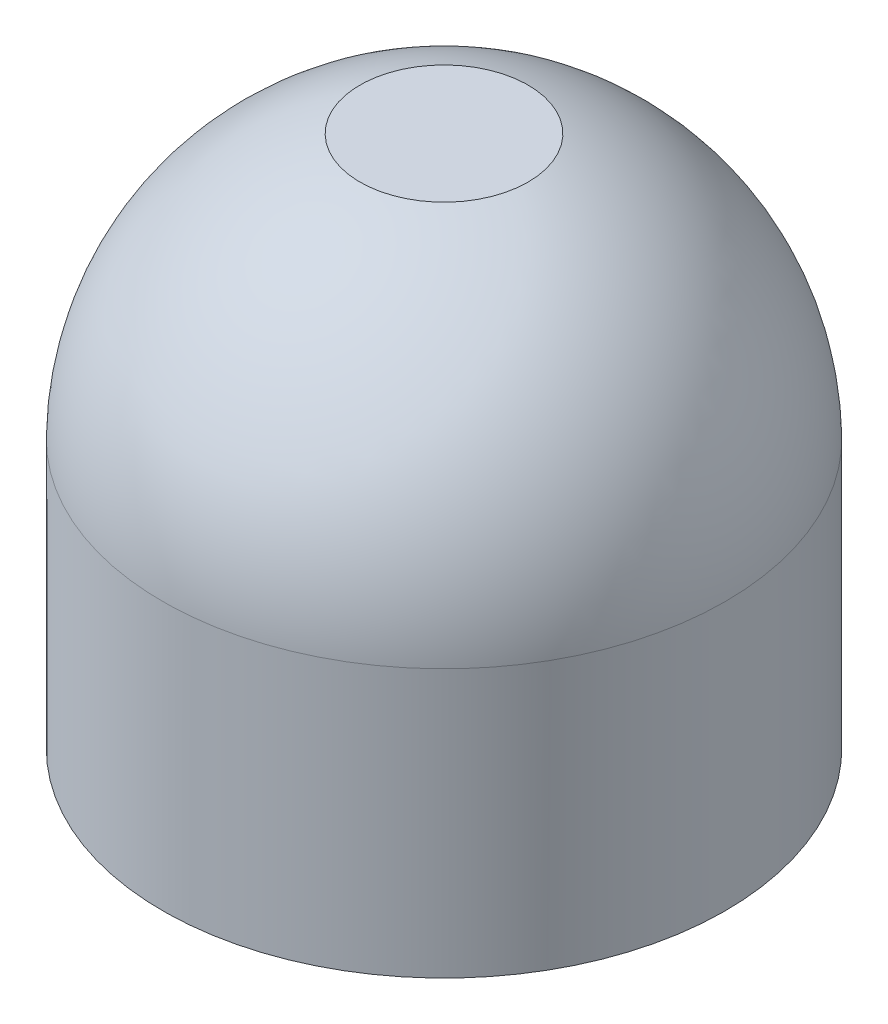
ISO-10303-21;
HEADER;
FILE_DESCRIPTION(('STEP AP214'),'2;1');
FILE_NAME('part.step','',(''),(''),'','','');
FILE_SCHEMA(('AUTOMOTIVE_DESIGN { 1 0 10303 214 1 1 1 1 }'));
ENDSEC;
DATA;
#1=APPLICATION_CONTEXT('core data for automotive mechanical design processes');
#2=APPLICATION_PROTOCOL_DEFINITION('international standard','automotive_design',2000,#1);
#3=PRODUCT_CONTEXT('',#1,'mechanical');
#4=PRODUCT('Part','Part','',(#3));
#5=PRODUCT_RELATED_PRODUCT_CATEGORY('part','',(#4));
#6=PRODUCT_DEFINITION_FORMATION('','',#4);
#7=PRODUCT_DEFINITION_CONTEXT('part definition',#1,'design');
#8=PRODUCT_DEFINITION('design','',#6,#7);
#9=PRODUCT_DEFINITION_SHAPE('','',#8);
#10=(LENGTH_UNIT() NAMED_UNIT(*) SI_UNIT(.MILLI.,.METRE.));
#11=(NAMED_UNIT(*) PLANE_ANGLE_UNIT() SI_UNIT($,.RADIAN.));
#12=(NAMED_UNIT(*) SI_UNIT($,.STERADIAN.) SOLID_ANGLE_UNIT());
#13=UNCERTAINTY_MEASURE_WITH_UNIT(LENGTH_MEASURE(1.E-05),#10,'distance_accuracy_value','');
#14=(GEOMETRIC_REPRESENTATION_CONTEXT(3) GLOBAL_UNCERTAINTY_ASSIGNED_CONTEXT((#13)) GLOBAL_UNIT_ASSIGNED_CONTEXT((#10,
#11,#12)) REPRESENTATION_CONTEXT('',''));
#15=CARTESIAN_POINT('',(0.,0.,0.));
#16=DIRECTION('',(0.,0.,1.));
#17=DIRECTION('',(1.,0.,0.));
#18=AXIS2_PLACEMENT_3D('',#15,#16,#17);
#19=CARTESIAN_POINT('',(0.,0.,0.));
#20=DIRECTION('',(0.,1.,0.));
#21=DIRECTION('',(0.,0.,1.));
#22=AXIS2_PLACEMENT_3D('',#19,#20,#21);
#23=PLANE('',#22);
#24=DIRECTION('',(0.,0.,-1.));
#25=VECTOR('',#24,1.);
#26=CARTESIAN_POINT('',(1.32768914699,0.,-3.79563732174866));
#27=LINE('',#26,#25);
#28=CARTESIAN_POINT('',(1.32768914699,0.,-4.29967923559014));
#29=VERTEX_POINT('',#28);
#30=CARTESIAN_POINT('',(1.32768914699,0.,-5.07934459639873));
#31=VERTEX_POINT('',#30);
#32=EDGE_CURVE('E57',#29,#31,#27,.T.);
#33=ORIENTED_EDGE('',*,*,#32,.T.);
#34=CARTESIAN_POINT('',(0.,0.,0.));
#35=DIRECTION('',(0.,1.,0.));
#36=DIRECTION('',(0.,0.,1.));
#37=AXIS2_PLACEMENT_3D('',#34,#35,#36);
#38=CIRCLE('',#37,5.25);
#39=CARTESIAN_POINT('',(-1.5,0.,-5.03115294937453));
#40=VERTEX_POINT('',#39);
#41=EDGE_CURVE('E134',#40,#31,#38,.T.);
#42=ORIENTED_EDGE('',*,*,#41,.F.);
#43=DIRECTION('',(0.,0.,1.));
#44=VECTOR('',#43,1.);
#45=CARTESIAN_POINT('',(-1.5,0.,-5.7011070865442));
#46=LINE('',#45,#44);
#47=CARTESIAN_POINT('',(-1.5,0.,-4.24264068711928));
#48=VERTEX_POINT('',#47);
#49=EDGE_CURVE('E122',#40,#48,#46,.T.);
#50=ORIENTED_EDGE('',*,*,#49,.T.);
#51=CARTESIAN_POINT('',(0.,0.,0.));
#52=DIRECTION('',(0.,1.,0.));
#53=DIRECTION('',(0.,0.,1.));
#54=AXIS2_PLACEMENT_3D('',#51,#52,#53);
#55=CIRCLE('',#54,4.5);
#56=EDGE_CURVE('E130',#48,#29,#55,.T.);
#57=ORIENTED_EDGE('',*,*,#56,.T.);
#58=EDGE_LOOP('',(#33,#42,#50,#57));
#59=FACE_BOUND('',#58,.T.);
#60=ADVANCED_FACE('F33',(#59),#23,.F.);
#61=CARTESIAN_POINT('',(0.,5.,0.));
#62=DIRECTION('',(0.,-1.,0.));
#63=DIRECTION('',(0.,0.,-1.));
#64=AXIS2_PLACEMENT_3D('',#61,#62,#63);
#65=CYLINDRICAL_SURFACE('',#64,5.25);
#66=DIRECTION('',(0.,-1.,0.));
#67=VECTOR('',#66,1.);
#68=CARTESIAN_POINT('',(1.32768914699,5.,-5.07934459639873));
#69=LINE('',#68,#67);
#70=CARTESIAN_POINT('',(1.32768914699,5.,-5.07934459639873));
#71=VERTEX_POINT('',#70);
#72=EDGE_CURVE('E128',#71,#31,#69,.T.);
#73=ORIENTED_EDGE('',*,*,#72,.F.);
#74=CARTESIAN_POINT('',(0.,5.,0.));
#75=DIRECTION('',(0.,1.,0.));
#76=DIRECTION('',(0.,0.,1.));
#77=AXIS2_PLACEMENT_3D('',#74,#75,#76);
#78=CIRCLE('',#77,5.25);
#79=CARTESIAN_POINT('',(-1.5,5.,-5.03115294937453));
#80=VERTEX_POINT('',#79);
#81=EDGE_CURVE('E137',#80,#71,#78,.T.);
#82=ORIENTED_EDGE('',*,*,#81,.F.);
#83=DIRECTION('',(0.,-1.,0.));
#84=VECTOR('',#83,1.);
#85=CARTESIAN_POINT('',(-1.5,5.,-5.03115294937453));
#86=LINE('',#85,#84);
#87=EDGE_CURVE('E125',#40,#80,#86,.F.);
#88=ORIENTED_EDGE('',*,*,#87,.F.);
#89=ORIENTED_EDGE('',*,*,#41,.T.);
#90=EDGE_LOOP('',(#73,#82,#88,#89));
#91=FACE_BOUND('',#90,.T.);
#92=ADVANCED_FACE('F35',(#91),#65,.T.);
#93=CARTESIAN_POINT('',(0.,5.,0.));
#94=DIRECTION('',(0.,-1.,0.));
#95=DIRECTION('',(0.,0.,-1.));
#96=AXIS2_PLACEMENT_3D('',#93,#94,#95);
#97=CYLINDRICAL_SURFACE('',#96,4.5);
#98=CARTESIAN_POINT('',(0.,5.,0.));
#99=DIRECTION('',(0.,1.,0.));
#100=DIRECTION('',(0.,0.,1.));
#101=AXIS2_PLACEMENT_3D('',#98,#99,#100);
#102=CIRCLE('',#101,4.5);
#103=CARTESIAN_POINT('',(-1.5,5.,-4.24264068711928));
#104=VERTEX_POINT('',#103);
#105=CARTESIAN_POINT('',(1.32768914699,5.,-4.29967923559014));
#106=VERTEX_POINT('',#105);
#107=EDGE_CURVE('E131',#104,#106,#102,.T.);
#108=ORIENTED_EDGE('',*,*,#107,.T.);
#109=DIRECTION('',(0.,-1.,0.));
#110=VECTOR('',#109,1.);
#111=CARTESIAN_POINT('',(1.32768914699,5.,-4.29967923559014));
#112=LINE('',#111,#110);
#113=EDGE_CURVE('E145',#106,#29,#112,.T.);
#114=ORIENTED_EDGE('',*,*,#113,.T.);
#115=ORIENTED_EDGE('',*,*,#56,.F.);
#116=DIRECTION('',(0.,-1.,0.));
#117=VECTOR('',#116,1.);
#118=CARTESIAN_POINT('',(-1.5,5.,-4.24264068711928));
#119=LINE('',#118,#117);
#120=EDGE_CURVE('E140',#48,#104,#119,.F.);
#121=ORIENTED_EDGE('',*,*,#120,.T.);
#122=EDGE_LOOP('',(#108,#114,#115,#121));
#123=FACE_BOUND('',#122,.T.);
#124=ADVANCED_FACE('F149',(#123),#97,.F.);
#125=CARTESIAN_POINT('',(-1.5,5.,-5.7011070865442));
#126=DIRECTION('',(1.,0.,0.));
#127=DIRECTION('',(0.,0.,-1.));
#128=AXIS2_PLACEMENT_3D('',#125,#126,#127);
#129=PLANE('',#128);
#130=ORIENTED_EDGE('',*,*,#87,.T.);
#131=CARTESIAN_POINT('',(-1.5,4.92952702702703,0.));
#132=DIRECTION('',(-1.,0.,0.));
#133=DIRECTION('',(0.,0.,1.));
#134=AXIS2_PLACEMENT_3D('',#131,#132,#133);
#135=CIRCLE('',#134,5.03164649393413);
#136=CARTESIAN_POINT('',(-1.5,7.,-4.58591409733197));
#137=VERTEX_POINT('',#136);
#138=EDGE_CURVE('E116',#80,#137,#135,.F.);
#139=ORIENTED_EDGE('',*,*,#138,.T.);
#140=DIRECTION('',(0.,0.,-1.));
#141=VECTOR('',#140,1.);
#142=CARTESIAN_POINT('',(-1.5,7.,-3.43693177121688));
#143=LINE('',#142,#141);
#144=CARTESIAN_POINT('',(-1.5,7.,-3.43693177121688));
#145=VERTEX_POINT('',#144);
#146=EDGE_CURVE('E106',#145,#137,#143,.T.);
#147=ORIENTED_EDGE('',*,*,#146,.F.);
#148=DIRECTION('',(0.,-1.,0.));
#149=VECTOR('',#148,1.);
#150=CARTESIAN_POINT('',(-1.5,7.,-3.43693177121688));
#151=LINE('',#150,#149);
#152=CARTESIAN_POINT('',(-1.5,5.,-3.43693177121688));
#153=VERTEX_POINT('',#152);
#154=EDGE_CURVE('E105',#145,#153,#151,.T.);
#155=ORIENTED_EDGE('',*,*,#154,.T.);
#156=DIRECTION('',(0.,0.,-1.));
#157=VECTOR('',#156,1.);
#158=CARTESIAN_POINT('',(-1.5,5.,-3.43693177121688));
#159=LINE('',#158,#157);
#160=EDGE_CURVE('E101',#153,#104,#159,.T.);
#161=ORIENTED_EDGE('',*,*,#160,.T.);
#162=ORIENTED_EDGE('',*,*,#120,.F.);
#163=ORIENTED_EDGE('',*,*,#49,.F.);
#164=EDGE_LOOP('',(#130,#139,#147,#155,#161,#162,#163));
#165=FACE_BOUND('',#164,.T.);
#166=ADVANCED_FACE('F155',(#165),#129,.T.);
#167=CARTESIAN_POINT('',(1.32768914699,5.,-3.79563732174866));
#168=DIRECTION('',(-1.,0.,0.));
#169=DIRECTION('',(0.,0.,1.));
#170=AXIS2_PLACEMENT_3D('',#167,#168,#169);
#171=PLANE('',#170);
#172=ORIENTED_EDGE('',*,*,#72,.T.);
#173=ORIENTED_EDGE('',*,*,#32,.F.);
#174=ORIENTED_EDGE('',*,*,#113,.F.);
#175=DIRECTION('',(0.,0.,1.));
#176=VECTOR('',#175,1.);
#177=CARTESIAN_POINT('',(1.32768914699,5.,0.));
#178=LINE('',#177,#176);
#179=CARTESIAN_POINT('',(1.32768914699,5.,-3.50709873384896));
#180=VERTEX_POINT('',#179);
#181=EDGE_CURVE('E42',#106,#180,#178,.T.);
#182=ORIENTED_EDGE('',*,*,#181,.T.);
#183=DIRECTION('',(0.,-1.,0.));
#184=VECTOR('',#183,1.);
#185=CARTESIAN_POINT('',(1.32768914699,7.,-3.50709873384896));
#186=LINE('',#185,#184);
#187=CARTESIAN_POINT('',(1.32768914699,7.,-3.50709873384896));
#188=VERTEX_POINT('',#187);
#189=EDGE_CURVE('E49',#188,#180,#186,.T.);
#190=ORIENTED_EDGE('',*,*,#189,.F.);
#191=DIRECTION('',(0.,0.,1.));
#192=VECTOR('',#191,1.);
#193=CARTESIAN_POINT('',(1.32768914699,7.,-3.50709873384896));
#194=LINE('',#193,#192);
#195=CARTESIAN_POINT('',(1.32768914699,7.,-4.63873362428509));
#196=VERTEX_POINT('',#195);
#197=EDGE_CURVE('E96',#196,#188,#194,.T.);
#198=ORIENTED_EDGE('',*,*,#197,.F.);
#199=CARTESIAN_POINT('',(1.32768914699,4.92952702702703,0.));
#200=DIRECTION('',(1.,0.,0.));
#201=DIRECTION('',(0.,0.,-1.));
#202=AXIS2_PLACEMENT_3D('',#199,#200,#201);
#203=CIRCLE('',#202,5.07983345877447);
#204=EDGE_CURVE('E119',#196,#71,#203,.F.);
#205=ORIENTED_EDGE('',*,*,#204,.T.);
#206=EDGE_LOOP('',(#172,#173,#174,#182,#190,#198,#205));
#207=FACE_BOUND('',#206,.T.);
#208=ADVANCED_FACE('F103',(#207),#171,.T.);
#209=CARTESIAN_POINT('',(0.,4.92952702702703,0.));
#210=DIRECTION('',(0.,-1.,0.));
#211=DIRECTION('',(1.,0.,0.));
#212=AXIS2_PLACEMENT_3D('',#209,#210,#211);
#213=SPHERICAL_SURFACE('',#212,5.25047297297297);
#214=CARTESIAN_POINT('',(0.,9.94,0.));
#215=DIRECTION('',(0.,-1.,0.));
#216=DIRECTION('',(1.,0.,0.));
#217=AXIS2_PLACEMENT_3D('',#214,#215,#216);
#218=CIRCLE('',#217,1.56927595630182);
#219=CARTESIAN_POINT('',(1.56927595630182,9.94,0.));
#220=VERTEX_POINT('',#219);
#221=EDGE_CURVE('E37',#220,#220,#218,.F.);
#222=ORIENTED_EDGE('',*,*,#221,.F.);
#223=EDGE_LOOP('',(#222));
#224=FACE_BOUND('',#223,.T.);
#225=ORIENTED_EDGE('',*,*,#204,.F.);
#226=CARTESIAN_POINT('',(0.,7.,0.));
#227=DIRECTION('',(0.,-1.,0.));
#228=DIRECTION('',(0.,0.,-1.));
#229=AXIS2_PLACEMENT_3D('',#226,#227,#228);
#230=CIRCLE('',#229,4.82499824954456);
#231=EDGE_CURVE('E11',#196,#137,#230,.F.);
#232=ORIENTED_EDGE('',*,*,#231,.T.);
#233=ORIENTED_EDGE('',*,*,#138,.F.);
#234=ORIENTED_EDGE('',*,*,#81,.T.);
#235=EDGE_LOOP('',(#225,#232,#233,#234));
#236=FACE_BOUND('',#235,.T.);
#237=ADVANCED_FACE('F160',(#224,#236),#213,.T.);
#238=CARTESIAN_POINT('',(5.25,5.,0.));
#239=DIRECTION('',(0.,-1.,0.));
#240=DIRECTION('',(0.,0.,-1.));
#241=AXIS2_PLACEMENT_3D('',#238,#239,#240);
#242=PLANE('',#241);
#243=ORIENTED_EDGE('',*,*,#181,.F.);
#244=ORIENTED_EDGE('',*,*,#107,.F.);
#245=ORIENTED_EDGE('',*,*,#160,.F.);
#246=CARTESIAN_POINT('',(0.,5.,0.));
#247=DIRECTION('',(0.,-1.,0.));
#248=DIRECTION('',(0.,0.,-1.));
#249=AXIS2_PLACEMENT_3D('',#246,#247,#248);
#250=CIRCLE('',#249,3.75);
#251=EDGE_CURVE('E113',#180,#153,#250,.T.);
#252=ORIENTED_EDGE('',*,*,#251,.F.);
#253=EDGE_LOOP('',(#243,#244,#245,#252));
#254=FACE_BOUND('',#253,.T.);
#255=ADVANCED_FACE('F163',(#254),#242,.T.);
#256=CARTESIAN_POINT('',(0.,7.,0.));
#257=DIRECTION('',(0.,-1.,0.));
#258=DIRECTION('',(0.,0.,-1.));
#259=AXIS2_PLACEMENT_3D('',#256,#257,#258);
#260=CYLINDRICAL_SURFACE('',#259,3.75);
#261=ORIENTED_EDGE('',*,*,#251,.T.);
#262=ORIENTED_EDGE('',*,*,#154,.F.);
#263=CARTESIAN_POINT('',(0.,7.,0.));
#264=DIRECTION('',(0.,-1.,0.));
#265=DIRECTION('',(0.,0.,-1.));
#266=AXIS2_PLACEMENT_3D('',#263,#264,#265);
#267=CIRCLE('',#266,3.75);
#268=EDGE_CURVE('E99',#188,#145,#267,.T.);
#269=ORIENTED_EDGE('',*,*,#268,.F.);
#270=ORIENTED_EDGE('',*,*,#189,.T.);
#271=EDGE_LOOP('',(#261,#262,#269,#270));
#272=FACE_BOUND('',#271,.T.);
#273=ADVANCED_FACE('F108',(#272),#260,.F.);
#274=CARTESIAN_POINT('',(0.,7.,0.));
#275=DIRECTION('',(0.,-1.,0.));
#276=DIRECTION('',(0.,0.,-1.));
#277=AXIS2_PLACEMENT_3D('',#274,#275,#276);
#278=PLANE('',#277);
#279=ORIENTED_EDGE('',*,*,#197,.T.);
#280=ORIENTED_EDGE('',*,*,#268,.T.);
#281=ORIENTED_EDGE('',*,*,#146,.T.);
#282=ORIENTED_EDGE('',*,*,#231,.F.);
#283=EDGE_LOOP('',(#279,#280,#281,#282));
#284=FACE_BOUND('',#283,.T.);
#285=ADVANCED_FACE('F97',(#284),#278,.T.);
#286=CARTESIAN_POINT('',(0.,9.94,0.));
#287=DIRECTION('',(0.,-1.,0.));
#288=DIRECTION('',(1.,0.,0.));
#289=AXIS2_PLACEMENT_3D('',#286,#287,#288);
#290=PLANE('',#289);
#291=ORIENTED_EDGE('',*,*,#221,.T.);
#292=EDGE_LOOP('',(#291));
#293=FACE_BOUND('',#292,.T.);
#294=ADVANCED_FACE('F207',(#293),#290,.F.);
#295=CLOSED_SHELL('',(#60,#92,#124,#166,#208,#237,#255,#273,#285,#294));
#296=MANIFOLD_SOLID_BREP('B2',#295);
#297=ADVANCED_BREP_SHAPE_REPRESENTATION('',(#18,#296),#14);
#298=SHAPE_DEFINITION_REPRESENTATION(#9,#297);
ENDSEC;
END-ISO-10303-21;
